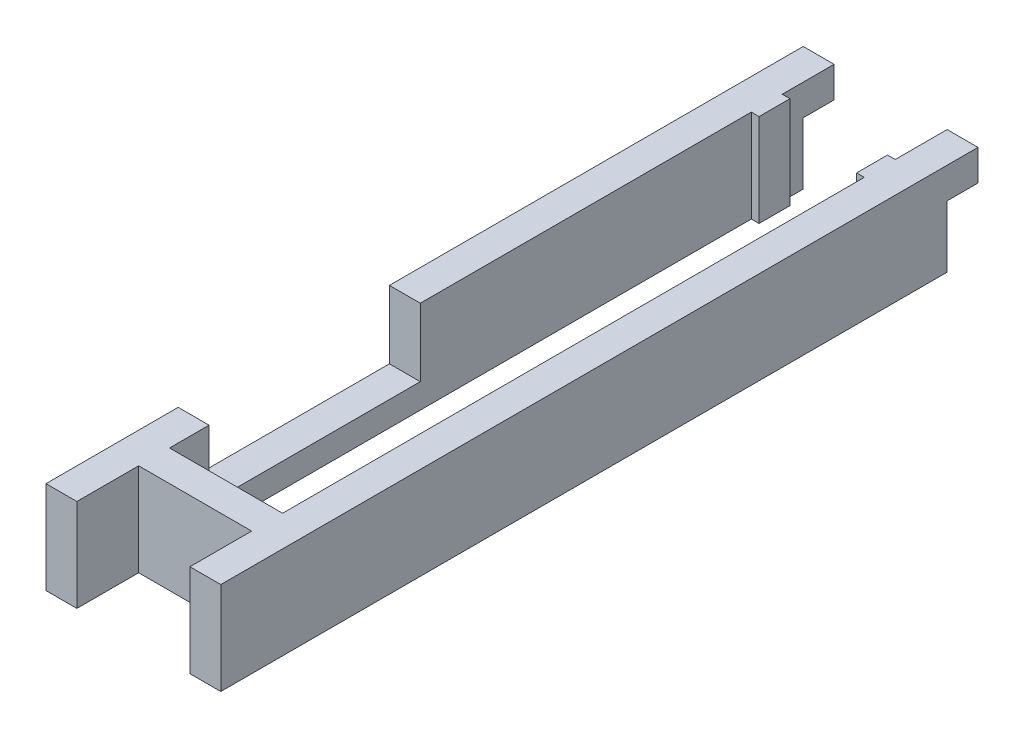
ISO-10303-21;
HEADER;
FILE_DESCRIPTION(('STEP AP214'),'2;1');
FILE_NAME('part.step','',(''),(''),'','','');
FILE_SCHEMA(('AUTOMOTIVE_DESIGN { 1 0 10303 214 1 1 1 1 }'));
ENDSEC;
DATA;
#1=APPLICATION_CONTEXT('core data for automotive mechanical design processes');
#2=APPLICATION_PROTOCOL_DEFINITION('international standard','automotive_design',2000,#1);
#3=PRODUCT_CONTEXT('',#1,'mechanical');
#4=PRODUCT('Part','Part','',(#3));
#5=PRODUCT_RELATED_PRODUCT_CATEGORY('part','',(#4));
#6=PRODUCT_DEFINITION_FORMATION('','',#4);
#7=PRODUCT_DEFINITION_CONTEXT('part definition',#1,'design');
#8=PRODUCT_DEFINITION('design','',#6,#7);
#9=PRODUCT_DEFINITION_SHAPE('','',#8);
#10=(LENGTH_UNIT() NAMED_UNIT(*) SI_UNIT(.MILLI.,.METRE.));
#11=(NAMED_UNIT(*) PLANE_ANGLE_UNIT() SI_UNIT($,.RADIAN.));
#12=(NAMED_UNIT(*) SI_UNIT($,.STERADIAN.) SOLID_ANGLE_UNIT());
#13=UNCERTAINTY_MEASURE_WITH_UNIT(LENGTH_MEASURE(1.E-05),#10,'distance_accuracy_value','');
#14=(GEOMETRIC_REPRESENTATION_CONTEXT(3) GLOBAL_UNCERTAINTY_ASSIGNED_CONTEXT((#13)) GLOBAL_UNIT_ASSIGNED_CONTEXT((#10,
#11,#12)) REPRESENTATION_CONTEXT('',''));
#15=CARTESIAN_POINT('',(0.,0.,0.));
#16=DIRECTION('',(0.,0.,1.));
#17=DIRECTION('',(1.,0.,0.));
#18=AXIS2_PLACEMENT_3D('',#15,#16,#17);
#19=CARTESIAN_POINT('',(0.,19.05,0.));
#20=DIRECTION('',(0.,1.,0.));
#21=DIRECTION('',(0.,0.,1.));
#22=AXIS2_PLACEMENT_3D('',#19,#20,#21);
#23=PLANE('',#22);
#24=DIRECTION('',(-1.,0.,0.));
#25=VECTOR('',#24,1.);
#26=CARTESIAN_POINT('',(0.,19.05,8.255));
#27=LINE('',#26,#25);
#28=CARTESIAN_POINT('',(-11.6205,19.05,8.255));
#29=VERTEX_POINT('',#28);
#30=CARTESIAN_POINT('',(-17.9705,19.05,8.255));
#31=VERTEX_POINT('',#30);
#32=EDGE_CURVE('E416',#29,#31,#27,.T.);
#33=ORIENTED_EDGE('',*,*,#32,.F.);
#34=DIRECTION('',(0.,0.,-1.));
#35=VECTOR('',#34,1.);
#36=CARTESIAN_POINT('',(-11.6205,19.05,59.817));
#37=LINE('',#36,#35);
#38=CARTESIAN_POINT('',(-11.6205,19.05,-59.817));
#39=VERTEX_POINT('',#38);
#40=EDGE_CURVE('E315',#29,#39,#37,.T.);
#41=ORIENTED_EDGE('',*,*,#40,.T.);
#42=DIRECTION('',(1.,0.,0.));
#43=VECTOR('',#42,1.);
#44=CARTESIAN_POINT('',(-11.6205,19.05,-59.817));
#45=LINE('',#44,#43);
#46=CARTESIAN_POINT('',(-10.033,19.05,-59.817));
#47=VERTEX_POINT('',#46);
#48=EDGE_CURVE('E319',#39,#47,#45,.T.);
#49=ORIENTED_EDGE('',*,*,#48,.T.);
#50=DIRECTION('',(0.,0.,-1.));
#51=VECTOR('',#50,1.);
#52=CARTESIAN_POINT('',(-10.033,19.05,-59.817));
#53=LINE('',#52,#51);
#54=CARTESIAN_POINT('',(-10.033,19.05,-66.167));
#55=VERTEX_POINT('',#54);
#56=EDGE_CURVE('E275',#47,#55,#53,.T.);
#57=ORIENTED_EDGE('',*,*,#56,.T.);
#58=DIRECTION('',(-1.,0.,0.));
#59=VECTOR('',#58,1.);
#60=CARTESIAN_POINT('',(-10.033,19.05,-66.167));
#61=LINE('',#60,#59);
#62=CARTESIAN_POINT('',(-11.6205,19.05,-66.167));
#63=VERTEX_POINT('',#62);
#64=EDGE_CURVE('E278',#55,#63,#61,.T.);
#65=ORIENTED_EDGE('',*,*,#64,.T.);
#66=DIRECTION('',(0.,0.,-1.));
#67=VECTOR('',#66,1.);
#68=CARTESIAN_POINT('',(-11.6205,19.05,-76.835));
#69=LINE('',#68,#67);
#70=CARTESIAN_POINT('',(-11.6205,19.05,-76.835));
#71=VERTEX_POINT('',#70);
#72=EDGE_CURVE('E281',#63,#71,#69,.T.);
#73=ORIENTED_EDGE('',*,*,#72,.T.);
#74=DIRECTION('',(-1.,0.,0.));
#75=VECTOR('',#74,1.);
#76=CARTESIAN_POINT('',(-17.9705,19.05,-76.835));
#77=LINE('',#76,#75);
#78=CARTESIAN_POINT('',(-17.9705,19.05,-76.835));
#79=VERTEX_POINT('',#78);
#80=EDGE_CURVE('E283',#71,#79,#77,.T.);
#81=ORIENTED_EDGE('',*,*,#80,.T.);
#82=DIRECTION('',(0.,0.,1.));
#83=VECTOR('',#82,1.);
#84=CARTESIAN_POINT('',(-17.9705,19.05,78.867));
#85=LINE('',#84,#83);
#86=EDGE_CURVE('E286',#79,#31,#85,.T.);
#87=ORIENTED_EDGE('',*,*,#86,.T.);
#88=EDGE_LOOP('',(#33,#41,#49,#57,#65,#73,#81,#87));
#89=FACE_BOUND('',#88,.T.);
#90=ADVANCED_FACE('F34',(#89),#23,.T.);
#91=CARTESIAN_POINT('',(-10.033,19.05,-59.817));
#92=DIRECTION('',(-1.,0.,0.));
#93=DIRECTION('',(0.,0.,1.));
#94=AXIS2_PLACEMENT_3D('',#91,#92,#93);
#95=PLANE('',#94);
#96=DIRECTION('',(0.,0.,-1.));
#97=VECTOR('',#96,1.);
#98=CARTESIAN_POINT('',(-10.033,0.,-59.817));
#99=LINE('',#98,#97);
#100=CARTESIAN_POINT('',(-10.033,0.,-59.817));
#101=VERTEX_POINT('',#100);
#102=CARTESIAN_POINT('',(-10.033,0.,-66.167));
#103=VERTEX_POINT('',#102);
#104=EDGE_CURVE('E274',#101,#103,#99,.T.);
#105=ORIENTED_EDGE('',*,*,#104,.T.);
#106=DIRECTION('',(0.,-1.,0.));
#107=VECTOR('',#106,1.);
#108=CARTESIAN_POINT('',(-10.033,19.05,-66.167));
#109=LINE('',#108,#107);
#110=EDGE_CURVE('E411',#55,#103,#109,.T.);
#111=ORIENTED_EDGE('',*,*,#110,.F.);
#112=ORIENTED_EDGE('',*,*,#56,.F.);
#113=DIRECTION('',(0.,-1.,0.));
#114=VECTOR('',#113,1.);
#115=CARTESIAN_POINT('',(-10.033,19.05,-59.817));
#116=LINE('',#115,#114);
#117=EDGE_CURVE('E321',#47,#101,#116,.T.);
#118=ORIENTED_EDGE('',*,*,#117,.T.);
#119=EDGE_LOOP('',(#105,#111,#112,#118));
#120=FACE_BOUND('',#119,.T.);
#121=ADVANCED_FACE('F36',(#120),#95,.F.);
#122=CARTESIAN_POINT('',(-10.033,19.05,-66.167));
#123=DIRECTION('',(0.,0.,1.));
#124=DIRECTION('',(1.,0.,0.));
#125=AXIS2_PLACEMENT_3D('',#122,#123,#124);
#126=PLANE('',#125);
#127=DIRECTION('',(-1.,0.,0.));
#128=VECTOR('',#127,1.);
#129=CARTESIAN_POINT('',(-10.033,0.,-66.167));
#130=LINE('',#129,#128);
#131=CARTESIAN_POINT('',(-11.6205,0.,-66.167));
#132=VERTEX_POINT('',#131);
#133=EDGE_CURVE('E324',#103,#132,#130,.T.);
#134=ORIENTED_EDGE('',*,*,#133,.T.);
#135=DIRECTION('',(0.,-1.,0.));
#136=VECTOR('',#135,1.);
#137=CARTESIAN_POINT('',(-11.6205,19.05,-66.167));
#138=LINE('',#137,#136);
#139=EDGE_CURVE('E408',#63,#132,#138,.T.);
#140=ORIENTED_EDGE('',*,*,#139,.F.);
#141=ORIENTED_EDGE('',*,*,#64,.F.);
#142=ORIENTED_EDGE('',*,*,#110,.T.);
#143=EDGE_LOOP('',(#134,#140,#141,#142));
#144=FACE_BOUND('',#143,.T.);
#145=ADVANCED_FACE('F432',(#144),#126,.F.);
#146=CARTESIAN_POINT('',(-11.6205,19.05,-76.835));
#147=DIRECTION('',(-1.,0.,0.));
#148=DIRECTION('',(0.,0.,1.));
#149=AXIS2_PLACEMENT_3D('',#146,#147,#148);
#150=PLANE('',#149);
#151=DIRECTION('',(0.,1.,0.));
#152=VECTOR('',#151,1.);
#153=CARTESIAN_POINT('',(-11.6205,19.05,-70.485));
#154=LINE('',#153,#152);
#155=CARTESIAN_POINT('',(-11.6205,0.,-70.485));
#156=VERTEX_POINT('',#155);
#157=CARTESIAN_POINT('',(-11.6205,12.7,-70.485));
#158=VERTEX_POINT('',#157);
#159=EDGE_CURVE('E49',#156,#158,#154,.T.);
#160=ORIENTED_EDGE('',*,*,#159,.T.);
#161=DIRECTION('',(0.,0.,-1.));
#162=VECTOR('',#161,1.);
#163=CARTESIAN_POINT('',(-11.6205,12.7,-76.835));
#164=LINE('',#163,#162);
#165=CARTESIAN_POINT('',(-11.6205,12.7,-76.835));
#166=VERTEX_POINT('',#165);
#167=EDGE_CURVE('E253',#158,#166,#164,.T.);
#168=ORIENTED_EDGE('',*,*,#167,.T.);
#169=DIRECTION('',(0.,-1.,0.));
#170=VECTOR('',#169,1.);
#171=CARTESIAN_POINT('',(-11.6205,19.05,-76.835));
#172=LINE('',#171,#170);
#173=EDGE_CURVE('E405',#71,#166,#172,.T.);
#174=ORIENTED_EDGE('',*,*,#173,.F.);
#175=ORIENTED_EDGE('',*,*,#72,.F.);
#176=ORIENTED_EDGE('',*,*,#139,.T.);
#177=DIRECTION('',(0.,0.,-1.));
#178=VECTOR('',#177,1.);
#179=CARTESIAN_POINT('',(-11.6205,0.,-76.835));
#180=LINE('',#179,#178);
#181=EDGE_CURVE('E326',#132,#156,#180,.T.);
#182=ORIENTED_EDGE('',*,*,#181,.T.);
#183=EDGE_LOOP('',(#160,#168,#174,#175,#176,#182));
#184=FACE_BOUND('',#183,.T.);
#185=ADVANCED_FACE('F427',(#184),#150,.F.);
#186=CARTESIAN_POINT('',(-17.9705,19.05,-76.835));
#187=DIRECTION('',(0.,0.,1.));
#188=DIRECTION('',(1.,0.,0.));
#189=AXIS2_PLACEMENT_3D('',#186,#187,#188);
#190=PLANE('',#189);
#191=ORIENTED_EDGE('',*,*,#173,.T.);
#192=DIRECTION('',(-1.,0.,0.));
#193=VECTOR('',#192,1.);
#194=CARTESIAN_POINT('',(17.9705,12.7,-76.835));
#195=LINE('',#194,#193);
#196=CARTESIAN_POINT('',(-17.9705,12.7,-76.835));
#197=VERTEX_POINT('',#196);
#198=EDGE_CURVE('E224',#166,#197,#195,.T.);
#199=ORIENTED_EDGE('',*,*,#198,.T.);
#200=DIRECTION('',(0.,-1.,0.));
#201=VECTOR('',#200,1.);
#202=CARTESIAN_POINT('',(-17.9705,19.05,-76.835));
#203=LINE('',#202,#201);
#204=EDGE_CURVE('E402',#79,#197,#203,.T.);
#205=ORIENTED_EDGE('',*,*,#204,.F.);
#206=ORIENTED_EDGE('',*,*,#80,.F.);
#207=EDGE_LOOP('',(#191,#199,#205,#206));
#208=FACE_BOUND('',#207,.T.);
#209=ADVANCED_FACE('F520',(#208),#190,.F.);
#210=CARTESIAN_POINT('',(-17.9705,19.05,78.867));
#211=DIRECTION('',(1.,0.,0.));
#212=DIRECTION('',(0.,0.,-1.));
#213=AXIS2_PLACEMENT_3D('',#210,#211,#212);
#214=PLANE('',#213);
#215=ORIENTED_EDGE('',*,*,#204,.T.);
#216=DIRECTION('',(0.,0.,-1.));
#217=VECTOR('',#216,1.);
#218=CARTESIAN_POINT('',(-17.9705,12.7,-76.835));
#219=LINE('',#218,#217);
#220=CARTESIAN_POINT('',(-17.9705,12.7,-70.485));
#221=VERTEX_POINT('',#220);
#222=EDGE_CURVE('E242',#221,#197,#219,.T.);
#223=ORIENTED_EDGE('',*,*,#222,.F.);
#224=DIRECTION('',(0.,1.,0.));
#225=VECTOR('',#224,1.);
#226=CARTESIAN_POINT('',(-17.9705,0.,-70.485));
#227=LINE('',#226,#225);
#228=CARTESIAN_POINT('',(-17.9705,0.,-70.485));
#229=VERTEX_POINT('',#228);
#230=EDGE_CURVE('E244',#229,#221,#227,.T.);
#231=ORIENTED_EDGE('',*,*,#230,.F.);
#232=DIRECTION('',(0.,0.,1.));
#233=VECTOR('',#232,1.);
#234=CARTESIAN_POINT('',(-17.9705,0.,78.867));
#235=LINE('',#234,#233);
#236=CARTESIAN_POINT('',(-17.9705,0.,78.867));
#237=VERTEX_POINT('',#236);
#238=EDGE_CURVE('E329',#229,#237,#235,.T.);
#239=ORIENTED_EDGE('',*,*,#238,.T.);
#240=DIRECTION('',(0.,-1.,0.));
#241=VECTOR('',#240,1.);
#242=CARTESIAN_POINT('',(-17.9705,19.05,78.867));
#243=LINE('',#242,#241);
#244=CARTESIAN_POINT('',(-17.9705,19.05,78.867));
#245=VERTEX_POINT('',#244);
#246=EDGE_CURVE('E399',#245,#237,#243,.T.);
#247=ORIENTED_EDGE('',*,*,#246,.F.);
#248=CARTESIAN_POINT('',(-17.9705,19.05,51.689));
#249=VERTEX_POINT('',#248);
#250=EDGE_CURVE('E285',#249,#245,#85,.T.);
#251=ORIENTED_EDGE('',*,*,#250,.F.);
#252=DIRECTION('',(0.,1.,0.));
#253=VECTOR('',#252,1.);
#254=CARTESIAN_POINT('',(-17.9705,19.05,51.689));
#255=LINE('',#254,#253);
#256=CARTESIAN_POINT('',(-17.9705,5.08,51.689));
#257=VERTEX_POINT('',#256);
#258=EDGE_CURVE('E262',#257,#249,#255,.T.);
#259=ORIENTED_EDGE('',*,*,#258,.F.);
#260=DIRECTION('',(0.,0.,1.));
#261=VECTOR('',#260,1.);
#262=CARTESIAN_POINT('',(-17.9705,5.08,8.255));
#263=LINE('',#262,#261);
#264=CARTESIAN_POINT('',(-17.9705,5.08,8.255));
#265=VERTEX_POINT('',#264);
#266=EDGE_CURVE('E259',#265,#257,#263,.T.);
#267=ORIENTED_EDGE('',*,*,#266,.F.);
#268=DIRECTION('',(0.,-1.,0.));
#269=VECTOR('',#268,1.);
#270=CARTESIAN_POINT('',(-17.9705,19.05,8.255));
#271=LINE('',#270,#269);
#272=EDGE_CURVE('E256',#31,#265,#271,.T.);
#273=ORIENTED_EDGE('',*,*,#272,.F.);
#274=ORIENTED_EDGE('',*,*,#86,.F.);
#275=EDGE_LOOP('',(#215,#223,#231,#239,#247,#251,#259,#267,#273,#274));
#276=FACE_BOUND('',#275,.T.);
#277=ADVANCED_FACE('F511',(#276),#214,.F.);
#278=CARTESIAN_POINT('',(-17.9705,19.05,78.867));
#279=DIRECTION('',(0.,0.,-1.));
#280=DIRECTION('',(-1.,0.,0.));
#281=AXIS2_PLACEMENT_3D('',#278,#279,#280);
#282=PLANE('',#281);
#283=DIRECTION('',(1.,0.,0.));
#284=VECTOR('',#283,1.);
#285=CARTESIAN_POINT('',(-17.9705,0.,78.867));
#286=LINE('',#285,#284);
#287=CARTESIAN_POINT('',(-11.6205,0.,78.867));
#288=VERTEX_POINT('',#287);
#289=EDGE_CURVE('E331',#237,#288,#286,.T.);
#290=ORIENTED_EDGE('',*,*,#289,.T.);
#291=DIRECTION('',(0.,-1.,0.));
#292=VECTOR('',#291,1.);
#293=CARTESIAN_POINT('',(-11.6205,19.05,78.867));
#294=LINE('',#293,#292);
#295=CARTESIAN_POINT('',(-11.6205,19.05,78.867));
#296=VERTEX_POINT('',#295);
#297=EDGE_CURVE('E396',#296,#288,#294,.T.);
#298=ORIENTED_EDGE('',*,*,#297,.F.);
#299=DIRECTION('',(1.,0.,0.));
#300=VECTOR('',#299,1.);
#301=CARTESIAN_POINT('',(-17.9705,19.05,78.867));
#302=LINE('',#301,#300);
#303=EDGE_CURVE('E289',#245,#296,#302,.T.);
#304=ORIENTED_EDGE('',*,*,#303,.F.);
#305=ORIENTED_EDGE('',*,*,#246,.T.);
#306=EDGE_LOOP('',(#290,#298,#304,#305));
#307=FACE_BOUND('',#306,.T.);
#308=ADVANCED_FACE('F507',(#307),#282,.F.);
#309=CARTESIAN_POINT('',(-11.6205,19.05,66.167));
#310=DIRECTION('',(-1.,0.,0.));
#311=DIRECTION('',(0.,0.,1.));
#312=AXIS2_PLACEMENT_3D('',#309,#310,#311);
#313=PLANE('',#312);
#314=DIRECTION('',(0.,0.,-1.));
#315=VECTOR('',#314,1.);
#316=CARTESIAN_POINT('',(-11.6205,0.,66.167));
#317=LINE('',#316,#315);
#318=CARTESIAN_POINT('',(-11.6205,0.,66.167));
#319=VERTEX_POINT('',#318);
#320=EDGE_CURVE('E333',#288,#319,#317,.T.);
#321=ORIENTED_EDGE('',*,*,#320,.T.);
#322=DIRECTION('',(0.,-1.,0.));
#323=VECTOR('',#322,1.);
#324=CARTESIAN_POINT('',(-11.6205,19.05,66.167));
#325=LINE('',#324,#323);
#326=CARTESIAN_POINT('',(-11.6205,19.05,66.167));
#327=VERTEX_POINT('',#326);
#328=EDGE_CURVE('E393',#327,#319,#325,.T.);
#329=ORIENTED_EDGE('',*,*,#328,.F.);
#330=DIRECTION('',(0.,0.,-1.));
#331=VECTOR('',#330,1.);
#332=CARTESIAN_POINT('',(-11.6205,19.05,66.167));
#333=LINE('',#332,#331);
#334=EDGE_CURVE('E291',#296,#327,#333,.T.);
#335=ORIENTED_EDGE('',*,*,#334,.F.);
#336=ORIENTED_EDGE('',*,*,#297,.T.);
#337=EDGE_LOOP('',(#321,#329,#335,#336));
#338=FACE_BOUND('',#337,.T.);
#339=ADVANCED_FACE('F502',(#338),#313,.F.);
#340=CARTESIAN_POINT('',(-11.6205,19.05,66.167));
#341=DIRECTION('',(0.,0.,-1.));
#342=DIRECTION('',(-1.,0.,0.));
#343=AXIS2_PLACEMENT_3D('',#340,#341,#342);
#344=PLANE('',#343);
#345=DIRECTION('',(1.,0.,0.));
#346=VECTOR('',#345,1.);
#347=CARTESIAN_POINT('',(-11.6205,0.,66.167));
#348=LINE('',#347,#346);
#349=CARTESIAN_POINT('',(11.6205,0.,66.167));
#350=VERTEX_POINT('',#349);
#351=EDGE_CURVE('E335',#319,#350,#348,.T.);
#352=ORIENTED_EDGE('',*,*,#351,.T.);
#353=DIRECTION('',(0.,-1.,0.));
#354=VECTOR('',#353,1.);
#355=CARTESIAN_POINT('',(11.6205,19.05,66.167));
#356=LINE('',#355,#354);
#357=CARTESIAN_POINT('',(11.6205,19.05,66.167));
#358=VERTEX_POINT('',#357);
#359=EDGE_CURVE('E390',#358,#350,#356,.T.);
#360=ORIENTED_EDGE('',*,*,#359,.F.);
#361=DIRECTION('',(1.,0.,0.));
#362=VECTOR('',#361,1.);
#363=CARTESIAN_POINT('',(-11.6205,19.05,66.167));
#364=LINE('',#363,#362);
#365=EDGE_CURVE('E293',#327,#358,#364,.T.);
#366=ORIENTED_EDGE('',*,*,#365,.F.);
#367=ORIENTED_EDGE('',*,*,#328,.T.);
#368=EDGE_LOOP('',(#352,#360,#366,#367));
#369=FACE_BOUND('',#368,.T.);
#370=ADVANCED_FACE('F498',(#369),#344,.F.);
#371=CARTESIAN_POINT('',(11.6205,19.05,66.167));
#372=DIRECTION('',(1.,0.,0.));
#373=DIRECTION('',(0.,0.,-1.));
#374=AXIS2_PLACEMENT_3D('',#371,#372,#373);
#375=PLANE('',#374);
#376=DIRECTION('',(0.,0.,1.));
#377=VECTOR('',#376,1.);
#378=CARTESIAN_POINT('',(11.6205,0.,66.167));
#379=LINE('',#378,#377);
#380=CARTESIAN_POINT('',(11.6205,0.,78.867));
#381=VERTEX_POINT('',#380);
#382=EDGE_CURVE('E337',#350,#381,#379,.T.);
#383=ORIENTED_EDGE('',*,*,#382,.T.);
#384=DIRECTION('',(0.,-1.,0.));
#385=VECTOR('',#384,1.);
#386=CARTESIAN_POINT('',(11.6205,19.05,78.867));
#387=LINE('',#386,#385);
#388=CARTESIAN_POINT('',(11.6205,19.05,78.867));
#389=VERTEX_POINT('',#388);
#390=EDGE_CURVE('E387',#389,#381,#387,.T.);
#391=ORIENTED_EDGE('',*,*,#390,.F.);
#392=DIRECTION('',(0.,0.,1.));
#393=VECTOR('',#392,1.);
#394=CARTESIAN_POINT('',(11.6205,19.05,66.167));
#395=LINE('',#394,#393);
#396=EDGE_CURVE('E295',#358,#389,#395,.T.);
#397=ORIENTED_EDGE('',*,*,#396,.F.);
#398=ORIENTED_EDGE('',*,*,#359,.T.);
#399=EDGE_LOOP('',(#383,#391,#397,#398));
#400=FACE_BOUND('',#399,.T.);
#401=ADVANCED_FACE('F496',(#400),#375,.F.);
#402=CARTESIAN_POINT('',(17.9705,19.05,78.867));
#403=DIRECTION('',(0.,0.,-1.));
#404=DIRECTION('',(-1.,0.,0.));
#405=AXIS2_PLACEMENT_3D('',#402,#403,#404);
#406=PLANE('',#405);
#407=DIRECTION('',(1.,0.,0.));
#408=VECTOR('',#407,1.);
#409=CARTESIAN_POINT('',(17.9705,0.,78.867));
#410=LINE('',#409,#408);
#411=CARTESIAN_POINT('',(17.9705,0.,78.867));
#412=VERTEX_POINT('',#411);
#413=EDGE_CURVE('E339',#381,#412,#410,.T.);
#414=ORIENTED_EDGE('',*,*,#413,.T.);
#415=DIRECTION('',(0.,-1.,0.));
#416=VECTOR('',#415,1.);
#417=CARTESIAN_POINT('',(17.9705,19.05,78.867));
#418=LINE('',#417,#416);
#419=CARTESIAN_POINT('',(17.9705,19.05,78.867));
#420=VERTEX_POINT('',#419);
#421=EDGE_CURVE('E385',#420,#412,#418,.T.);
#422=ORIENTED_EDGE('',*,*,#421,.F.);
#423=DIRECTION('',(1.,0.,0.));
#424=VECTOR('',#423,1.);
#425=CARTESIAN_POINT('',(17.9705,19.05,78.867));
#426=LINE('',#425,#424);
#427=EDGE_CURVE('E297',#389,#420,#426,.T.);
#428=ORIENTED_EDGE('',*,*,#427,.F.);
#429=ORIENTED_EDGE('',*,*,#390,.T.);
#430=EDGE_LOOP('',(#414,#422,#428,#429));
#431=FACE_BOUND('',#430,.T.);
#432=ADVANCED_FACE('F483',(#431),#406,.F.);
#433=CARTESIAN_POINT('',(17.9705,19.05,-76.835));
#434=DIRECTION('',(-1.,0.,0.));
#435=DIRECTION('',(0.,0.,1.));
#436=AXIS2_PLACEMENT_3D('',#433,#434,#435);
#437=PLANE('',#436);
#438=DIRECTION('',(0.,1.,0.));
#439=VECTOR('',#438,1.);
#440=CARTESIAN_POINT('',(17.9705,0.,-70.485));
#441=LINE('',#440,#439);
#442=CARTESIAN_POINT('',(17.9705,0.,-70.485));
#443=VERTEX_POINT('',#442);
#444=CARTESIAN_POINT('',(17.9705,12.7,-70.485));
#445=VERTEX_POINT('',#444);
#446=EDGE_CURVE('E57',#443,#445,#441,.T.);
#447=ORIENTED_EDGE('',*,*,#446,.T.);
#448=DIRECTION('',(0.,0.,-1.));
#449=VECTOR('',#448,1.);
#450=CARTESIAN_POINT('',(17.9705,12.7,-76.835));
#451=LINE('',#450,#449);
#452=CARTESIAN_POINT('',(17.9705,12.7,-76.835));
#453=VERTEX_POINT('',#452);
#454=EDGE_CURVE('E228',#445,#453,#451,.T.);
#455=ORIENTED_EDGE('',*,*,#454,.T.);
#456=DIRECTION('',(0.,-1.,0.));
#457=VECTOR('',#456,1.);
#458=CARTESIAN_POINT('',(17.9705,19.05,-76.835));
#459=LINE('',#458,#457);
#460=CARTESIAN_POINT('',(17.9705,19.05,-76.835));
#461=VERTEX_POINT('',#460);
#462=EDGE_CURVE('E383',#461,#453,#459,.T.);
#463=ORIENTED_EDGE('',*,*,#462,.F.);
#464=DIRECTION('',(0.,0.,-1.));
#465=VECTOR('',#464,1.);
#466=CARTESIAN_POINT('',(17.9705,19.05,-76.835));
#467=LINE('',#466,#465);
#468=EDGE_CURVE('E299',#420,#461,#467,.T.);
#469=ORIENTED_EDGE('',*,*,#468,.F.);
#470=ORIENTED_EDGE('',*,*,#421,.T.);
#471=DIRECTION('',(0.,0.,-1.));
#472=VECTOR('',#471,1.);
#473=CARTESIAN_POINT('',(17.9705,0.,-76.835));
#474=LINE('',#473,#472);
#475=EDGE_CURVE('E241',#412,#443,#474,.T.);
#476=ORIENTED_EDGE('',*,*,#475,.T.);
#477=EDGE_LOOP('',(#447,#455,#463,#469,#470,#476));
#478=FACE_BOUND('',#477,.T.);
#479=ADVANCED_FACE('F238',(#478),#437,.F.);
#480=CARTESIAN_POINT('',(11.6205,19.05,-76.835));
#481=DIRECTION('',(0.,0.,1.));
#482=DIRECTION('',(1.,0.,0.));
#483=AXIS2_PLACEMENT_3D('',#480,#481,#482);
#484=PLANE('',#483);
#485=ORIENTED_EDGE('',*,*,#462,.T.);
#486=CARTESIAN_POINT('',(11.6205,12.7,-76.835));
#487=VERTEX_POINT('',#486);
#488=EDGE_CURVE('E231',#453,#487,#195,.T.);
#489=ORIENTED_EDGE('',*,*,#488,.T.);
#490=DIRECTION('',(0.,-1.,0.));
#491=VECTOR('',#490,1.);
#492=CARTESIAN_POINT('',(11.6205,19.05,-76.835));
#493=LINE('',#492,#491);
#494=CARTESIAN_POINT('',(11.6205,19.05,-76.835));
#495=VERTEX_POINT('',#494);
#496=EDGE_CURVE('E380',#495,#487,#493,.T.);
#497=ORIENTED_EDGE('',*,*,#496,.F.);
#498=DIRECTION('',(-1.,0.,0.));
#499=VECTOR('',#498,1.);
#500=CARTESIAN_POINT('',(11.6205,19.05,-76.835));
#501=LINE('',#500,#499);
#502=EDGE_CURVE('E301',#461,#495,#501,.T.);
#503=ORIENTED_EDGE('',*,*,#502,.F.);
#504=EDGE_LOOP('',(#485,#489,#497,#503));
#505=FACE_BOUND('',#504,.T.);
#506=ADVANCED_FACE('F573',(#505),#484,.F.);
#507=CARTESIAN_POINT('',(11.6205,19.05,-66.167));
#508=DIRECTION('',(1.,0.,0.));
#509=DIRECTION('',(0.,0.,-1.));
#510=AXIS2_PLACEMENT_3D('',#507,#508,#509);
#511=PLANE('',#510);
#512=ORIENTED_EDGE('',*,*,#496,.T.);
#513=DIRECTION('',(0.,0.,1.));
#514=VECTOR('',#513,1.);
#515=CARTESIAN_POINT('',(11.6205,12.7,-66.167));
#516=LINE('',#515,#514);
#517=CARTESIAN_POINT('',(11.6205,12.7,-70.485));
#518=VERTEX_POINT('',#517);
#519=EDGE_CURVE('E11',#487,#518,#516,.T.);
#520=ORIENTED_EDGE('',*,*,#519,.T.);
#521=DIRECTION('',(0.,-1.,0.));
#522=VECTOR('',#521,1.);
#523=CARTESIAN_POINT('',(11.6205,19.05,-70.485));
#524=LINE('',#523,#522);
#525=CARTESIAN_POINT('',(11.6205,0.,-70.485));
#526=VERTEX_POINT('',#525);
#527=EDGE_CURVE('E222',#518,#526,#524,.T.);
#528=ORIENTED_EDGE('',*,*,#527,.T.);
#529=DIRECTION('',(0.,0.,1.));
#530=VECTOR('',#529,1.);
#531=CARTESIAN_POINT('',(11.6205,0.,-66.167));
#532=LINE('',#531,#530);
#533=CARTESIAN_POINT('',(11.6205,0.,-66.167));
#534=VERTEX_POINT('',#533);
#535=EDGE_CURVE('E342',#526,#534,#532,.T.);
#536=ORIENTED_EDGE('',*,*,#535,.T.);
#537=DIRECTION('',(0.,-1.,0.));
#538=VECTOR('',#537,1.);
#539=CARTESIAN_POINT('',(11.6205,19.05,-66.167));
#540=LINE('',#539,#538);
#541=CARTESIAN_POINT('',(11.6205,19.05,-66.167));
#542=VERTEX_POINT('',#541);
#543=EDGE_CURVE('E377',#542,#534,#540,.T.);
#544=ORIENTED_EDGE('',*,*,#543,.F.);
#545=DIRECTION('',(0.,0.,1.));
#546=VECTOR('',#545,1.);
#547=CARTESIAN_POINT('',(11.6205,19.05,-66.167));
#548=LINE('',#547,#546);
#549=EDGE_CURVE('E303',#495,#542,#548,.T.);
#550=ORIENTED_EDGE('',*,*,#549,.F.);
#551=EDGE_LOOP('',(#512,#520,#528,#536,#544,#550));
#552=FACE_BOUND('',#551,.T.);
#553=ADVANCED_FACE('F477',(#552),#511,.F.);
#554=CARTESIAN_POINT('',(11.6205,19.05,-66.167));
#555=DIRECTION('',(0.,0.,1.));
#556=DIRECTION('',(1.,0.,0.));
#557=AXIS2_PLACEMENT_3D('',#554,#555,#556);
#558=PLANE('',#557);
#559=DIRECTION('',(-1.,0.,0.));
#560=VECTOR('',#559,1.);
#561=CARTESIAN_POINT('',(11.6205,0.,-66.167));
#562=LINE('',#561,#560);
#563=CARTESIAN_POINT('',(10.033,0.,-66.167));
#564=VERTEX_POINT('',#563);
#565=EDGE_CURVE('E344',#534,#564,#562,.T.);
#566=ORIENTED_EDGE('',*,*,#565,.T.);
#567=DIRECTION('',(0.,-1.,0.));
#568=VECTOR('',#567,1.);
#569=CARTESIAN_POINT('',(10.033,19.05,-66.167));
#570=LINE('',#569,#568);
#571=CARTESIAN_POINT('',(10.033,19.05,-66.167));
#572=VERTEX_POINT('',#571);
#573=EDGE_CURVE('E374',#572,#564,#570,.T.);
#574=ORIENTED_EDGE('',*,*,#573,.F.);
#575=DIRECTION('',(-1.,0.,0.));
#576=VECTOR('',#575,1.);
#577=CARTESIAN_POINT('',(11.6205,19.05,-66.167));
#578=LINE('',#577,#576);
#579=EDGE_CURVE('E305',#542,#572,#578,.T.);
#580=ORIENTED_EDGE('',*,*,#579,.F.);
#581=ORIENTED_EDGE('',*,*,#543,.T.);
#582=EDGE_LOOP('',(#566,#574,#580,#581));
#583=FACE_BOUND('',#582,.T.);
#584=ADVANCED_FACE('F473',(#583),#558,.F.);
#585=CARTESIAN_POINT('',(10.033,19.05,-66.167));
#586=DIRECTION('',(1.,0.,0.));
#587=DIRECTION('',(0.,0.,-1.));
#588=AXIS2_PLACEMENT_3D('',#585,#586,#587);
#589=PLANE('',#588);
#590=DIRECTION('',(0.,0.,1.));
#591=VECTOR('',#590,1.);
#592=CARTESIAN_POINT('',(10.033,0.,-66.167));
#593=LINE('',#592,#591);
#594=CARTESIAN_POINT('',(10.033,0.,-59.817));
#595=VERTEX_POINT('',#594);
#596=EDGE_CURVE('E346',#564,#595,#593,.T.);
#597=ORIENTED_EDGE('',*,*,#596,.T.);
#598=DIRECTION('',(0.,-1.,0.));
#599=VECTOR('',#598,1.);
#600=CARTESIAN_POINT('',(10.033,19.05,-59.817));
#601=LINE('',#600,#599);
#602=CARTESIAN_POINT('',(10.033,19.05,-59.817));
#603=VERTEX_POINT('',#602);
#604=EDGE_CURVE('E371',#603,#595,#601,.T.);
#605=ORIENTED_EDGE('',*,*,#604,.F.);
#606=DIRECTION('',(0.,0.,1.));
#607=VECTOR('',#606,1.);
#608=CARTESIAN_POINT('',(10.033,19.05,-66.167));
#609=LINE('',#608,#607);
#610=EDGE_CURVE('E307',#572,#603,#609,.T.);
#611=ORIENTED_EDGE('',*,*,#610,.F.);
#612=ORIENTED_EDGE('',*,*,#573,.T.);
#613=EDGE_LOOP('',(#597,#605,#611,#612));
#614=FACE_BOUND('',#613,.T.);
#615=ADVANCED_FACE('F468',(#614),#589,.F.);
#616=CARTESIAN_POINT('',(10.033,19.05,-59.817));
#617=DIRECTION('',(0.,0.,-1.));
#618=DIRECTION('',(-1.,0.,0.));
#619=AXIS2_PLACEMENT_3D('',#616,#617,#618);
#620=PLANE('',#619);
#621=DIRECTION('',(1.,0.,0.));
#622=VECTOR('',#621,1.);
#623=CARTESIAN_POINT('',(10.033,0.,-59.817));
#624=LINE('',#623,#622);
#625=CARTESIAN_POINT('',(11.6205,0.,-59.817));
#626=VERTEX_POINT('',#625);
#627=EDGE_CURVE('E348',#595,#626,#624,.T.);
#628=ORIENTED_EDGE('',*,*,#627,.T.);
#629=DIRECTION('',(0.,-1.,0.));
#630=VECTOR('',#629,1.);
#631=CARTESIAN_POINT('',(11.6205,19.05,-59.817));
#632=LINE('',#631,#630);
#633=CARTESIAN_POINT('',(11.6205,19.05,-59.817));
#634=VERTEX_POINT('',#633);
#635=EDGE_CURVE('E368',#634,#626,#632,.T.);
#636=ORIENTED_EDGE('',*,*,#635,.F.);
#637=DIRECTION('',(1.,0.,0.));
#638=VECTOR('',#637,1.);
#639=CARTESIAN_POINT('',(10.033,19.05,-59.817));
#640=LINE('',#639,#638);
#641=EDGE_CURVE('E309',#603,#634,#640,.T.);
#642=ORIENTED_EDGE('',*,*,#641,.F.);
#643=ORIENTED_EDGE('',*,*,#604,.T.);
#644=EDGE_LOOP('',(#628,#636,#642,#643));
#645=FACE_BOUND('',#644,.T.);
#646=ADVANCED_FACE('F462',(#645),#620,.F.);
#647=CARTESIAN_POINT('',(11.6205,19.05,-59.817));
#648=DIRECTION('',(1.,0.,0.));
#649=DIRECTION('',(0.,0.,-1.));
#650=AXIS2_PLACEMENT_3D('',#647,#648,#649);
#651=PLANE('',#650);
#652=DIRECTION('',(0.,0.,1.));
#653=VECTOR('',#652,1.);
#654=CARTESIAN_POINT('',(11.6205,0.,-59.817));
#655=LINE('',#654,#653);
#656=CARTESIAN_POINT('',(11.6205,0.,59.817));
#657=VERTEX_POINT('',#656);
#658=EDGE_CURVE('E350',#626,#657,#655,.T.);
#659=ORIENTED_EDGE('',*,*,#658,.T.);
#660=DIRECTION('',(0.,-1.,0.));
#661=VECTOR('',#660,1.);
#662=CARTESIAN_POINT('',(11.6205,19.05,59.817));
#663=LINE('',#662,#661);
#664=CARTESIAN_POINT('',(11.6205,19.05,59.817));
#665=VERTEX_POINT('',#664);
#666=EDGE_CURVE('E365',#665,#657,#663,.T.);
#667=ORIENTED_EDGE('',*,*,#666,.F.);
#668=DIRECTION('',(0.,0.,1.));
#669=VECTOR('',#668,1.);
#670=CARTESIAN_POINT('',(11.6205,19.05,-59.817));
#671=LINE('',#670,#669);
#672=EDGE_CURVE('E311',#634,#665,#671,.T.);
#673=ORIENTED_EDGE('',*,*,#672,.F.);
#674=ORIENTED_EDGE('',*,*,#635,.T.);
#675=EDGE_LOOP('',(#659,#667,#673,#674));
#676=FACE_BOUND('',#675,.T.);
#677=ADVANCED_FACE('F458',(#676),#651,.F.);
#678=CARTESIAN_POINT('',(11.6205,19.05,59.817));
#679=DIRECTION('',(0.,0.,1.));
#680=DIRECTION('',(1.,0.,0.));
#681=AXIS2_PLACEMENT_3D('',#678,#679,#680);
#682=PLANE('',#681);
#683=DIRECTION('',(-1.,0.,0.));
#684=VECTOR('',#683,1.);
#685=CARTESIAN_POINT('',(11.6205,0.,59.817));
#686=LINE('',#685,#684);
#687=CARTESIAN_POINT('',(-11.6205,0.,59.817));
#688=VERTEX_POINT('',#687);
#689=EDGE_CURVE('E352',#657,#688,#686,.T.);
#690=ORIENTED_EDGE('',*,*,#689,.T.);
#691=DIRECTION('',(0.,-1.,0.));
#692=VECTOR('',#691,1.);
#693=CARTESIAN_POINT('',(-11.6205,19.05,59.817));
#694=LINE('',#693,#692);
#695=CARTESIAN_POINT('',(-11.6205,19.05,59.817));
#696=VERTEX_POINT('',#695);
#697=EDGE_CURVE('E362',#696,#688,#694,.T.);
#698=ORIENTED_EDGE('',*,*,#697,.F.);
#699=DIRECTION('',(-1.,0.,0.));
#700=VECTOR('',#699,1.);
#701=CARTESIAN_POINT('',(11.6205,19.05,59.817));
#702=LINE('',#701,#700);
#703=EDGE_CURVE('E313',#665,#696,#702,.T.);
#704=ORIENTED_EDGE('',*,*,#703,.F.);
#705=ORIENTED_EDGE('',*,*,#666,.T.);
#706=EDGE_LOOP('',(#690,#698,#704,#705));
#707=FACE_BOUND('',#706,.T.);
#708=ADVANCED_FACE('F453',(#707),#682,.F.);
#709=CARTESIAN_POINT('',(-11.6205,19.05,59.817));
#710=DIRECTION('',(-1.,0.,0.));
#711=DIRECTION('',(0.,0.,1.));
#712=AXIS2_PLACEMENT_3D('',#709,#710,#711);
#713=PLANE('',#712);
#714=ORIENTED_EDGE('',*,*,#40,.F.);
#715=DIRECTION('',(0.,-1.,0.));
#716=VECTOR('',#715,1.);
#717=CARTESIAN_POINT('',(-11.6205,19.05,8.255));
#718=LINE('',#717,#716);
#719=CARTESIAN_POINT('',(-11.6205,5.08,8.255));
#720=VERTEX_POINT('',#719);
#721=EDGE_CURVE('E271',#29,#720,#718,.T.);
#722=ORIENTED_EDGE('',*,*,#721,.T.);
#723=DIRECTION('',(0.,0.,1.));
#724=VECTOR('',#723,1.);
#725=CARTESIAN_POINT('',(-11.6205,5.08,59.817));
#726=LINE('',#725,#724);
#727=CARTESIAN_POINT('',(-11.6205,5.08,51.689));
#728=VERTEX_POINT('',#727);
#729=EDGE_CURVE('E418',#720,#728,#726,.T.);
#730=ORIENTED_EDGE('',*,*,#729,.T.);
#731=DIRECTION('',(0.,1.,0.));
#732=VECTOR('',#731,1.);
#733=CARTESIAN_POINT('',(-11.6205,19.05,51.689));
#734=LINE('',#733,#732);
#735=CARTESIAN_POINT('',(-11.6205,19.05,51.689));
#736=VERTEX_POINT('',#735);
#737=EDGE_CURVE('E267',#728,#736,#734,.T.);
#738=ORIENTED_EDGE('',*,*,#737,.T.);
#739=EDGE_CURVE('E316',#696,#736,#37,.T.);
#740=ORIENTED_EDGE('',*,*,#739,.F.);
#741=ORIENTED_EDGE('',*,*,#697,.T.);
#742=DIRECTION('',(0.,0.,-1.));
#743=VECTOR('',#742,1.);
#744=CARTESIAN_POINT('',(-11.6205,0.,59.817));
#745=LINE('',#744,#743);
#746=CARTESIAN_POINT('',(-11.6205,0.,-59.817));
#747=VERTEX_POINT('',#746);
#748=EDGE_CURVE('E354',#688,#747,#745,.T.);
#749=ORIENTED_EDGE('',*,*,#748,.T.);
#750=DIRECTION('',(0.,-1.,0.));
#751=VECTOR('',#750,1.);
#752=CARTESIAN_POINT('',(-11.6205,19.05,-59.817));
#753=LINE('',#752,#751);
#754=EDGE_CURVE('E359',#39,#747,#753,.T.);
#755=ORIENTED_EDGE('',*,*,#754,.F.);
#756=EDGE_LOOP('',(#714,#722,#730,#738,#740,#741,#749,#755));
#757=FACE_BOUND('',#756,.T.);
#758=ADVANCED_FACE('F446',(#757),#713,.F.);
#759=CARTESIAN_POINT('',(-11.6205,19.05,-59.817));
#760=DIRECTION('',(0.,0.,-1.));
#761=DIRECTION('',(-1.,0.,0.));
#762=AXIS2_PLACEMENT_3D('',#759,#760,#761);
#763=PLANE('',#762);
#764=DIRECTION('',(1.,0.,0.));
#765=VECTOR('',#764,1.);
#766=CARTESIAN_POINT('',(-11.6205,0.,-59.817));
#767=LINE('',#766,#765);
#768=EDGE_CURVE('E279',#747,#101,#767,.T.);
#769=ORIENTED_EDGE('',*,*,#768,.T.);
#770=ORIENTED_EDGE('',*,*,#117,.F.);
#771=ORIENTED_EDGE('',*,*,#48,.F.);
#772=ORIENTED_EDGE('',*,*,#754,.T.);
#773=EDGE_LOOP('',(#769,#770,#771,#772));
#774=FACE_BOUND('',#773,.T.);
#775=ADVANCED_FACE('F442',(#774),#763,.F.);
#776=DIRECTION('',(1.,0.,0.));
#777=VECTOR('',#776,1.);
#778=CARTESIAN_POINT('',(0.,19.05,51.689));
#779=LINE('',#778,#777);
#780=EDGE_CURVE('E414',#249,#736,#779,.T.);
#781=ORIENTED_EDGE('',*,*,#780,.F.);
#782=ORIENTED_EDGE('',*,*,#250,.T.);
#783=ORIENTED_EDGE('',*,*,#303,.T.);
#784=ORIENTED_EDGE('',*,*,#334,.T.);
#785=ORIENTED_EDGE('',*,*,#365,.T.);
#786=ORIENTED_EDGE('',*,*,#396,.T.);
#787=ORIENTED_EDGE('',*,*,#427,.T.);
#788=ORIENTED_EDGE('',*,*,#468,.T.);
#789=ORIENTED_EDGE('',*,*,#502,.T.);
#790=ORIENTED_EDGE('',*,*,#549,.T.);
#791=ORIENTED_EDGE('',*,*,#579,.T.);
#792=ORIENTED_EDGE('',*,*,#610,.T.);
#793=ORIENTED_EDGE('',*,*,#641,.T.);
#794=ORIENTED_EDGE('',*,*,#672,.T.);
#795=ORIENTED_EDGE('',*,*,#703,.T.);
#796=ORIENTED_EDGE('',*,*,#739,.T.);
#797=EDGE_LOOP('',(#781,#782,#783,#784,#785,#786,#787,#788,#789,#790,#791,#792,#793,#794,#795,#796));
#798=FACE_BOUND('',#797,.T.);
#799=ADVANCED_FACE('F490',(#798),#23,.T.);
#800=CARTESIAN_POINT('',(0.,0.,0.));
#801=DIRECTION('',(0.,1.,0.));
#802=DIRECTION('',(0.,0.,1.));
#803=AXIS2_PLACEMENT_3D('',#800,#801,#802);
#804=PLANE('',#803);
#805=ORIENTED_EDGE('',*,*,#238,.F.);
#806=DIRECTION('',(1.,0.,0.));
#807=VECTOR('',#806,1.);
#808=CARTESIAN_POINT('',(0.,0.,-70.485));
#809=LINE('',#808,#807);
#810=EDGE_CURVE('E42',#229,#156,#809,.T.);
#811=ORIENTED_EDGE('',*,*,#810,.T.);
#812=ORIENTED_EDGE('',*,*,#181,.F.);
#813=ORIENTED_EDGE('',*,*,#133,.F.);
#814=ORIENTED_EDGE('',*,*,#104,.F.);
#815=ORIENTED_EDGE('',*,*,#768,.F.);
#816=ORIENTED_EDGE('',*,*,#748,.F.);
#817=ORIENTED_EDGE('',*,*,#689,.F.);
#818=ORIENTED_EDGE('',*,*,#658,.F.);
#819=ORIENTED_EDGE('',*,*,#627,.F.);
#820=ORIENTED_EDGE('',*,*,#596,.F.);
#821=ORIENTED_EDGE('',*,*,#565,.F.);
#822=ORIENTED_EDGE('',*,*,#535,.F.);
#823=DIRECTION('',(-1.,0.,0.));
#824=VECTOR('',#823,1.);
#825=CARTESIAN_POINT('',(17.9705,0.,-70.485));
#826=LINE('',#825,#824);
#827=EDGE_CURVE('E235',#443,#526,#826,.T.);
#828=ORIENTED_EDGE('',*,*,#827,.F.);
#829=ORIENTED_EDGE('',*,*,#475,.F.);
#830=ORIENTED_EDGE('',*,*,#413,.F.);
#831=ORIENTED_EDGE('',*,*,#382,.F.);
#832=ORIENTED_EDGE('',*,*,#351,.F.);
#833=ORIENTED_EDGE('',*,*,#320,.F.);
#834=ORIENTED_EDGE('',*,*,#289,.F.);
#835=EDGE_LOOP('',(#805,#811,#812,#813,#814,#815,#816,#817,#818,#819,#820,#821,#822,#828,#829,
#830,#831,#832,#833,#834));
#836=FACE_BOUND('',#835,.T.);
#837=ADVANCED_FACE('F423',(#836),#804,.F.);
#838=CARTESIAN_POINT('',(1.07950000000002,5.08,8.255));
#839=DIRECTION('',(0.,-1.,0.));
#840=DIRECTION('',(0.,0.,-1.));
#841=AXIS2_PLACEMENT_3D('',#838,#839,#840);
#842=PLANE('',#841);
#843=DIRECTION('',(-1.,0.,0.));
#844=VECTOR('',#843,1.);
#845=CARTESIAN_POINT('',(1.07950000000002,5.08,8.255));
#846=LINE('',#845,#844);
#847=EDGE_CURVE('E264',#720,#265,#846,.T.);
#848=ORIENTED_EDGE('',*,*,#847,.T.);
#849=ORIENTED_EDGE('',*,*,#266,.T.);
#850=DIRECTION('',(-1.,0.,0.));
#851=VECTOR('',#850,1.);
#852=CARTESIAN_POINT('',(1.07950000000002,5.08,51.689));
#853=LINE('',#852,#851);
#854=EDGE_CURVE('E265',#728,#257,#853,.T.);
#855=ORIENTED_EDGE('',*,*,#854,.F.);
#856=ORIENTED_EDGE('',*,*,#729,.F.);
#857=EDGE_LOOP('',(#848,#849,#855,#856));
#858=FACE_BOUND('',#857,.T.);
#859=ADVANCED_FACE('F532',(#858),#842,.F.);
#860=CARTESIAN_POINT('',(1.07950000000002,19.05,8.255));
#861=DIRECTION('',(0.,0.,-1.));
#862=DIRECTION('',(-1.,0.,0.));
#863=AXIS2_PLACEMENT_3D('',#860,#861,#862);
#864=PLANE('',#863);
#865=ORIENTED_EDGE('',*,*,#32,.T.);
#866=ORIENTED_EDGE('',*,*,#272,.T.);
#867=ORIENTED_EDGE('',*,*,#847,.F.);
#868=ORIENTED_EDGE('',*,*,#721,.F.);
#869=EDGE_LOOP('',(#865,#866,#867,#868));
#870=FACE_BOUND('',#869,.T.);
#871=ADVANCED_FACE('F527',(#870),#864,.F.);
#872=CARTESIAN_POINT('',(1.07950000000002,19.05,51.689));
#873=DIRECTION('',(0.,0.,1.));
#874=DIRECTION('',(1.,0.,0.));
#875=AXIS2_PLACEMENT_3D('',#872,#873,#874);
#876=PLANE('',#875);
#877=ORIENTED_EDGE('',*,*,#854,.T.);
#878=ORIENTED_EDGE('',*,*,#258,.T.);
#879=ORIENTED_EDGE('',*,*,#780,.T.);
#880=ORIENTED_EDGE('',*,*,#737,.F.);
#881=EDGE_LOOP('',(#877,#878,#879,#880));
#882=FACE_BOUND('',#881,.T.);
#883=ADVANCED_FACE('F534',(#882),#876,.F.);
#884=CARTESIAN_POINT('',(17.9705,0.,-70.485));
#885=DIRECTION('',(0.,0.,1.));
#886=DIRECTION('',(1.,0.,0.));
#887=AXIS2_PLACEMENT_3D('',#884,#885,#886);
#888=PLANE('',#887);
#889=DIRECTION('',(-1.,0.,0.));
#890=VECTOR('',#889,1.);
#891=CARTESIAN_POINT('',(17.9705,12.7,-70.485));
#892=LINE('',#891,#890);
#893=EDGE_CURVE('E218',#445,#518,#892,.T.);
#894=ORIENTED_EDGE('',*,*,#893,.F.);
#895=ORIENTED_EDGE('',*,*,#446,.F.);
#896=ORIENTED_EDGE('',*,*,#827,.T.);
#897=ORIENTED_EDGE('',*,*,#527,.F.);
#898=EDGE_LOOP('',(#894,#895,#896,#897));
#899=FACE_BOUND('',#898,.T.);
#900=ADVANCED_FACE('F220',(#899),#888,.F.);
#901=CARTESIAN_POINT('',(17.9705,12.7,-76.835));
#902=DIRECTION('',(0.,1.,0.));
#903=DIRECTION('',(0.,0.,1.));
#904=AXIS2_PLACEMENT_3D('',#901,#902,#903);
#905=PLANE('',#904);
#906=ORIENTED_EDGE('',*,*,#488,.F.);
#907=ORIENTED_EDGE('',*,*,#454,.F.);
#908=ORIENTED_EDGE('',*,*,#893,.T.);
#909=ORIENTED_EDGE('',*,*,#519,.F.);
#910=EDGE_LOOP('',(#906,#907,#908,#909));
#911=FACE_BOUND('',#910,.T.);
#912=ADVANCED_FACE('F229',(#911),#905,.F.);
#913=EDGE_CURVE('E225',#158,#221,#892,.T.);
#914=ORIENTED_EDGE('',*,*,#913,.T.);
#915=ORIENTED_EDGE('',*,*,#222,.T.);
#916=ORIENTED_EDGE('',*,*,#198,.F.);
#917=ORIENTED_EDGE('',*,*,#167,.F.);
#918=EDGE_LOOP('',(#914,#915,#916,#917));
#919=FACE_BOUND('',#918,.T.);
#920=ADVANCED_FACE('F516',(#919),#905,.F.);
#921=ORIENTED_EDGE('',*,*,#810,.F.);
#922=ORIENTED_EDGE('',*,*,#230,.T.);
#923=ORIENTED_EDGE('',*,*,#913,.F.);
#924=ORIENTED_EDGE('',*,*,#159,.F.);
#925=EDGE_LOOP('',(#921,#922,#923,#924));
#926=FACE_BOUND('',#925,.T.);
#927=ADVANCED_FACE('F514',(#926),#888,.F.);
#928=CLOSED_SHELL('',(#90,#121,#145,#185,#209,#277,#308,#339,#370,#401,#432,#479,#506,#553,#584,
#615,#646,#677,#708,#758,#775,#799,#837,#859,#871,#883,#900,#912,#920,#927));
#929=MANIFOLD_SOLID_BREP('B2',#928);
#930=ADVANCED_BREP_SHAPE_REPRESENTATION('',(#18,#929),#14);
#931=SHAPE_DEFINITION_REPRESENTATION(#9,#930);
ENDSEC;
END-ISO-10303-21;
